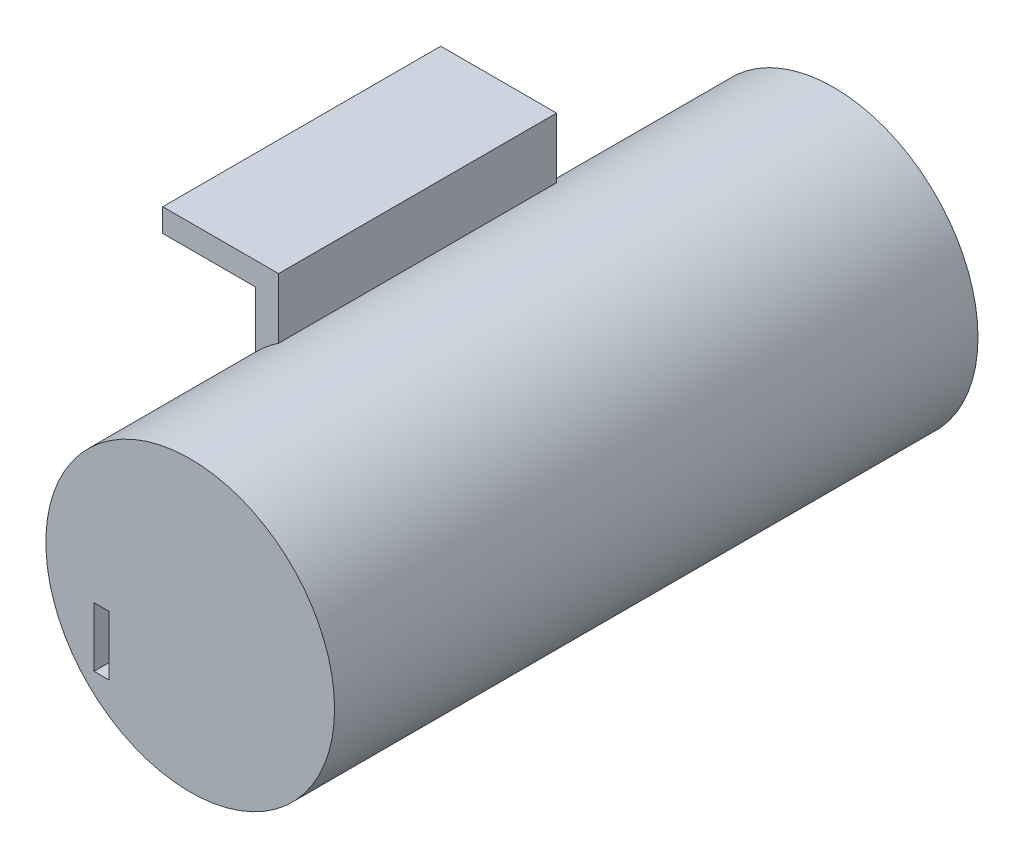
ISO-10303-21;
HEADER;
FILE_DESCRIPTION(('STEP AP214'),'2;1');
FILE_NAME('part.step','',(''),(''),'','','');
FILE_SCHEMA(('AUTOMOTIVE_DESIGN { 1 0 10303 214 1 1 1 1 }'));
ENDSEC;
DATA;
#1=APPLICATION_CONTEXT('core data for automotive mechanical design processes');
#2=APPLICATION_PROTOCOL_DEFINITION('international standard','automotive_design',2000,#1);
#3=PRODUCT_CONTEXT('',#1,'mechanical');
#4=PRODUCT('Part','Part','',(#3));
#5=PRODUCT_RELATED_PRODUCT_CATEGORY('part','',(#4));
#6=PRODUCT_DEFINITION_FORMATION('','',#4);
#7=PRODUCT_DEFINITION_CONTEXT('part definition',#1,'design');
#8=PRODUCT_DEFINITION('design','',#6,#7);
#9=PRODUCT_DEFINITION_SHAPE('','',#8);
#10=(LENGTH_UNIT() NAMED_UNIT(*) SI_UNIT(.MILLI.,.METRE.));
#11=(NAMED_UNIT(*) PLANE_ANGLE_UNIT() SI_UNIT($,.RADIAN.));
#12=(NAMED_UNIT(*) SI_UNIT($,.STERADIAN.) SOLID_ANGLE_UNIT());
#13=UNCERTAINTY_MEASURE_WITH_UNIT(LENGTH_MEASURE(1.E-05),#10,'distance_accuracy_value','');
#14=(GEOMETRIC_REPRESENTATION_CONTEXT(3) GLOBAL_UNCERTAINTY_ASSIGNED_CONTEXT((#13)) GLOBAL_UNIT_ASSIGNED_CONTEXT((#10,
#11,#12)) REPRESENTATION_CONTEXT('',''));
#15=CARTESIAN_POINT('',(0.,0.,0.));
#16=DIRECTION('',(0.,0.,1.));
#17=DIRECTION('',(1.,0.,0.));
#18=AXIS2_PLACEMENT_3D('',#15,#16,#17);
#19=CARTESIAN_POINT('',(-9.81200661546478,0.,38.1));
#20=DIRECTION('',(1.,0.,0.));
#21=DIRECTION('',(0.,1.,0.));
#22=AXIS2_PLACEMENT_3D('',#19,#20,#21);
#23=PLANE('',#22);
#24=DIRECTION('',(0.,0.,1.));
#25=VECTOR('',#24,1.);
#26=CARTESIAN_POINT('',(-9.81200661546478,0.974223450392017,-27.));
#27=LINE('',#26,#25);
#28=CARTESIAN_POINT('',(-9.81200661546478,0.974223450392015,38.1));
#29=VERTEX_POINT('',#28);
#30=CARTESIAN_POINT('',(-9.81200661546478,0.974223450392015,0.));
#31=VERTEX_POINT('',#30);
#32=EDGE_CURVE('E189',#29,#31,#27,.F.);
#33=ORIENTED_EDGE('',*,*,#32,.F.);
#34=DIRECTION('',(0.,-1.,0.));
#35=VECTOR('',#34,1.);
#36=CARTESIAN_POINT('',(-9.81200661546478,0.,38.1));
#37=LINE('',#36,#35);
#38=CARTESIAN_POINT('',(-9.81200661546479,8.7007021203464,38.1));
#39=VERTEX_POINT('',#38);
#40=EDGE_CURVE('E202',#39,#29,#37,.T.);
#41=ORIENTED_EDGE('',*,*,#40,.F.);
#42=DIRECTION('',(0.,0.,-1.));
#43=VECTOR('',#42,1.);
#44=CARTESIAN_POINT('',(-9.81200661546479,8.7007021203464,38.1));
#45=LINE('',#44,#43);
#46=CARTESIAN_POINT('',(-9.81200661546479,8.7007021203464,0.));
#47=VERTEX_POINT('',#46);
#48=EDGE_CURVE('E236',#39,#47,#45,.T.);
#49=ORIENTED_EDGE('',*,*,#48,.T.);
#50=DIRECTION('',(0.,-1.,0.));
#51=VECTOR('',#50,1.);
#52=CARTESIAN_POINT('',(-9.81200661546478,0.,0.));
#53=LINE('',#52,#51);
#54=EDGE_CURVE('E220',#47,#31,#53,.T.);
#55=ORIENTED_EDGE('',*,*,#54,.T.);
#56=EDGE_LOOP('',(#33,#41,#49,#55));
#57=FACE_BOUND('',#56,.T.);
#58=ADVANCED_FACE('F36',(#57),#23,.F.);
#59=CARTESIAN_POINT('',(-6.63700661546478,0.,38.1));
#60=DIRECTION('',(1.,0.,0.));
#61=DIRECTION('',(0.,1.,0.));
#62=AXIS2_PLACEMENT_3D('',#59,#60,#61);
#63=PLANE('',#62);
#64=DIRECTION('',(0.,-1.,0.));
#65=VECTOR('',#64,1.);
#66=CARTESIAN_POINT('',(-6.63700661546478,0.,38.1));
#67=LINE('',#66,#65);
#68=CARTESIAN_POINT('',(-6.63700661546479,11.8757021203464,38.1));
#69=VERTEX_POINT('',#68);
#70=CARTESIAN_POINT('',(-6.63700661546478,3.60496778517396,38.1));
#71=VERTEX_POINT('',#70);
#72=EDGE_CURVE('E209',#69,#71,#67,.T.);
#73=ORIENTED_EDGE('',*,*,#72,.T.);
#74=DIRECTION('',(0.,0.,1.));
#75=VECTOR('',#74,1.);
#76=CARTESIAN_POINT('',(-6.63700661546478,3.60496778517396,-27.));
#77=LINE('',#76,#75);
#78=CARTESIAN_POINT('',(-6.63700661546478,3.60496778517396,0.));
#79=VERTEX_POINT('',#78);
#80=EDGE_CURVE('E186',#71,#79,#77,.F.);
#81=ORIENTED_EDGE('',*,*,#80,.T.);
#82=DIRECTION('',(0.,-1.,0.));
#83=VECTOR('',#82,1.);
#84=CARTESIAN_POINT('',(-6.63700661546478,0.,0.));
#85=LINE('',#84,#83);
#86=CARTESIAN_POINT('',(-6.63700661546479,11.8757021203464,0.));
#87=VERTEX_POINT('',#86);
#88=EDGE_CURVE('E226',#87,#79,#85,.T.);
#89=ORIENTED_EDGE('',*,*,#88,.F.);
#90=DIRECTION('',(0.,0.,-1.));
#91=VECTOR('',#90,1.);
#92=CARTESIAN_POINT('',(-6.63700661546479,11.8757021203464,38.1));
#93=LINE('',#92,#91);
#94=EDGE_CURVE('E231',#69,#87,#93,.T.);
#95=ORIENTED_EDGE('',*,*,#94,.F.);
#96=EDGE_LOOP('',(#73,#81,#89,#95));
#97=FACE_BOUND('',#96,.T.);
#98=ADVANCED_FACE('F267',(#97),#63,.T.);
#99=CARTESIAN_POINT('',(-22.5120066154648,0.,38.1));
#100=DIRECTION('',(-1.,0.,0.));
#101=DIRECTION('',(0.,0.,1.));
#102=AXIS2_PLACEMENT_3D('',#99,#100,#101);
#103=PLANE('',#102);
#104=DIRECTION('',(0.,1.,0.));
#105=VECTOR('',#104,1.);
#106=CARTESIAN_POINT('',(-22.5120066154648,0.,0.));
#107=LINE('',#106,#105);
#108=CARTESIAN_POINT('',(-22.5120066154648,8.7007021203464,0.));
#109=VERTEX_POINT('',#108);
#110=CARTESIAN_POINT('',(-22.5120066154648,11.8757021203464,0.));
#111=VERTEX_POINT('',#110);
#112=EDGE_CURVE('E194',#109,#111,#107,.T.);
#113=ORIENTED_EDGE('',*,*,#112,.F.);
#114=DIRECTION('',(0.,0.,-1.));
#115=VECTOR('',#114,1.);
#116=CARTESIAN_POINT('',(-22.5120066154648,8.7007021203464,38.1));
#117=LINE('',#116,#115);
#118=CARTESIAN_POINT('',(-22.5120066154648,8.7007021203464,38.1));
#119=VERTEX_POINT('',#118);
#120=EDGE_CURVE('E238',#119,#109,#117,.T.);
#121=ORIENTED_EDGE('',*,*,#120,.F.);
#122=DIRECTION('',(0.,1.,0.));
#123=VECTOR('',#122,1.);
#124=CARTESIAN_POINT('',(-22.5120066154648,0.,38.1));
#125=LINE('',#124,#123);
#126=CARTESIAN_POINT('',(-22.5120066154648,11.8757021203464,38.1));
#127=VERTEX_POINT('',#126);
#128=EDGE_CURVE('E195',#119,#127,#125,.T.);
#129=ORIENTED_EDGE('',*,*,#128,.T.);
#130=DIRECTION('',(0.,0.,-1.));
#131=VECTOR('',#130,1.);
#132=CARTESIAN_POINT('',(-22.5120066154648,11.8757021203464,38.1));
#133=LINE('',#132,#131);
#134=EDGE_CURVE('E214',#127,#111,#133,.T.);
#135=ORIENTED_EDGE('',*,*,#134,.T.);
#136=EDGE_LOOP('',(#113,#121,#129,#135));
#137=FACE_BOUND('',#136,.T.);
#138=ADVANCED_FACE('F38',(#137),#103,.T.);
#139=CARTESIAN_POINT('',(0.,8.7007021203464,38.1));
#140=DIRECTION('',(0.,-1.,0.));
#141=DIRECTION('',(0.,0.,-1.));
#142=AXIS2_PLACEMENT_3D('',#139,#140,#141);
#143=PLANE('',#142);
#144=DIRECTION('',(-1.,0.,0.));
#145=VECTOR('',#144,1.);
#146=CARTESIAN_POINT('',(0.,8.7007021203464,0.));
#147=LINE('',#146,#145);
#148=EDGE_CURVE('E217',#47,#109,#147,.T.);
#149=ORIENTED_EDGE('',*,*,#148,.F.);
#150=ORIENTED_EDGE('',*,*,#48,.F.);
#151=DIRECTION('',(-1.,0.,0.));
#152=VECTOR('',#151,1.);
#153=CARTESIAN_POINT('',(0.,8.7007021203464,38.1));
#154=LINE('',#153,#152);
#155=EDGE_CURVE('E198',#39,#119,#154,.T.);
#156=ORIENTED_EDGE('',*,*,#155,.T.);
#157=ORIENTED_EDGE('',*,*,#120,.T.);
#158=EDGE_LOOP('',(#149,#150,#156,#157));
#159=FACE_BOUND('',#158,.T.);
#160=ADVANCED_FACE('F282',(#159),#143,.T.);
#161=CARTESIAN_POINT('',(0.,11.8757021203464,38.1));
#162=DIRECTION('',(0.,-1.,0.));
#163=DIRECTION('',(1.,0.,0.));
#164=AXIS2_PLACEMENT_3D('',#161,#162,#163);
#165=PLANE('',#164);
#166=DIRECTION('',(-1.,0.,0.));
#167=VECTOR('',#166,1.);
#168=CARTESIAN_POINT('',(0.,11.8757021203464,0.));
#169=LINE('',#168,#167);
#170=EDGE_CURVE('E199',#87,#111,#169,.T.);
#171=ORIENTED_EDGE('',*,*,#170,.T.);
#172=ORIENTED_EDGE('',*,*,#134,.F.);
#173=DIRECTION('',(-1.,0.,0.));
#174=VECTOR('',#173,1.);
#175=CARTESIAN_POINT('',(0.,11.8757021203464,38.1));
#176=LINE('',#175,#174);
#177=EDGE_CURVE('E212',#69,#127,#176,.T.);
#178=ORIENTED_EDGE('',*,*,#177,.F.);
#179=ORIENTED_EDGE('',*,*,#94,.T.);
#180=EDGE_LOOP('',(#171,#172,#178,#179));
#181=FACE_BOUND('',#180,.T.);
#182=ADVANCED_FACE('F272',(#181),#165,.F.);
#183=CARTESIAN_POINT('',(0.,0.,38.1));
#184=DIRECTION('',(0.,0.,1.));
#185=DIRECTION('',(1.,0.,0.));
#186=AXIS2_PLACEMENT_3D('',#183,#184,#185);
#187=PLANE('',#186);
#188=ORIENTED_EDGE('',*,*,#40,.T.);
#189=CARTESIAN_POINT('',(4.32977813053361,-12.8619542844802,38.1));
#190=DIRECTION('',(0.,0.,1.));
#191=DIRECTION('',(1.,0.,0.));
#192=AXIS2_PLACEMENT_3D('',#189,#190,#191);
#193=CIRCLE('',#192,19.7845871858153);
#194=EDGE_CURVE('E192',#29,#71,#193,.F.);
#195=ORIENTED_EDGE('',*,*,#194,.T.);
#196=ORIENTED_EDGE('',*,*,#72,.F.);
#197=ORIENTED_EDGE('',*,*,#177,.T.);
#198=ORIENTED_EDGE('',*,*,#128,.F.);
#199=ORIENTED_EDGE('',*,*,#155,.F.);
#200=EDGE_LOOP('',(#188,#195,#196,#197,#198,#199));
#201=FACE_BOUND('',#200,.T.);
#202=ADVANCED_FACE('F261',(#201),#187,.T.);
#203=CARTESIAN_POINT('',(0.,0.,0.));
#204=DIRECTION('',(0.,0.,1.));
#205=DIRECTION('',(1.,0.,0.));
#206=AXIS2_PLACEMENT_3D('',#203,#204,#205);
#207=PLANE('',#206);
#208=CARTESIAN_POINT('',(4.32977813053361,-12.8619542844802,0.));
#209=DIRECTION('',(0.,0.,1.));
#210=DIRECTION('',(1.,0.,0.));
#211=AXIS2_PLACEMENT_3D('',#208,#209,#210);
#212=CIRCLE('',#211,19.7845871858153);
#213=EDGE_CURVE('E11',#31,#79,#212,.F.);
#214=ORIENTED_EDGE('',*,*,#213,.F.);
#215=ORIENTED_EDGE('',*,*,#54,.F.);
#216=ORIENTED_EDGE('',*,*,#148,.T.);
#217=ORIENTED_EDGE('',*,*,#112,.T.);
#218=ORIENTED_EDGE('',*,*,#170,.F.);
#219=ORIENTED_EDGE('',*,*,#88,.T.);
#220=EDGE_LOOP('',(#214,#215,#216,#217,#218,#219));
#221=FACE_BOUND('',#220,.T.);
#222=ADVANCED_FACE('F269',(#221),#207,.F.);
#223=CARTESIAN_POINT('',(4.32977813053361,-12.8619542844802,-27.));
#224=DIRECTION('',(0.,0.,-1.));
#225=DIRECTION('',(-1.,0.,0.));
#226=AXIS2_PLACEMENT_3D('',#223,#224,#225);
#227=PLANE('',#226);
#228=CARTESIAN_POINT('',(4.32977813053361,-12.8619542844802,-27.));
#229=DIRECTION('',(0.,0.,-1.));
#230=DIRECTION('',(-1.,0.,0.));
#231=AXIS2_PLACEMENT_3D('',#228,#229,#230);
#232=CIRCLE('',#231,19.7845871858153);
#233=CARTESIAN_POINT('',(-15.4548090552817,-12.8619542844802,-27.));
#234=VERTEX_POINT('',#233);
#235=EDGE_CURVE('E176',#234,#234,#232,.T.);
#236=ORIENTED_EDGE('',*,*,#235,.T.);
#237=EDGE_LOOP('',(#236));
#238=FACE_BOUND('',#237,.T.);
#239=CARTESIAN_POINT('',(4.32977813053361,-12.8619542844802,-27.));
#240=DIRECTION('',(0.,0.,-1.));
#241=DIRECTION('',(-1.,0.,0.));
#242=AXIS2_PLACEMENT_3D('',#239,#240,#241);
#243=CIRCLE('',#242,18.3999999999997);
#244=CARTESIAN_POINT('',(-14.0702218694661,-12.8619542844802,-27.));
#245=VERTEX_POINT('',#244);
#246=EDGE_CURVE('E173',#245,#245,#243,.T.);
#247=ORIENTED_EDGE('',*,*,#246,.F.);
#248=EDGE_LOOP('',(#247));
#249=FACE_BOUND('',#248,.T.);
#250=ADVANCED_FACE('F310',(#238,#249),#227,.T.);
#251=CARTESIAN_POINT('',(4.32977813053361,-12.8619542844802,-27.));
#252=DIRECTION('',(0.,0.,1.));
#253=DIRECTION('',(1.,0.,0.));
#254=AXIS2_PLACEMENT_3D('',#251,#252,#253);
#255=CYLINDRICAL_SURFACE('',#254,19.7845871858153);
#256=ORIENTED_EDGE('',*,*,#194,.F.);
#257=ORIENTED_EDGE('',*,*,#32,.T.);
#258=ORIENTED_EDGE('',*,*,#213,.T.);
#259=ORIENTED_EDGE('',*,*,#80,.F.);
#260=EDGE_LOOP('',(#256,#257,#258,#259));
#261=FACE_BOUND('',#260,.T.);
#262=ORIENTED_EDGE('',*,*,#235,.F.);
#263=EDGE_LOOP('',(#262));
#264=FACE_BOUND('',#263,.T.);
#265=CARTESIAN_POINT('',(4.32977813053361,-12.8619542844802,61.175));
#266=DIRECTION('',(0.,0.,1.));
#267=DIRECTION('',(1.,0.,0.));
#268=AXIS2_PLACEMENT_3D('',#265,#266,#267);
#269=CIRCLE('',#268,19.7845871858153);
#270=CARTESIAN_POINT('',(24.1143653163489,-12.8619542844802,61.175));
#271=VERTEX_POINT('',#270);
#272=EDGE_CURVE('E164',#271,#271,#269,.T.);
#273=ORIENTED_EDGE('',*,*,#272,.F.);
#274=EDGE_LOOP('',(#273));
#275=FACE_BOUND('',#274,.T.);
#276=ADVANCED_FACE('F300',(#261,#264,#275),#255,.T.);
#277=CARTESIAN_POINT('',(4.32977813053361,-12.8619542844802,-27.));
#278=DIRECTION('',(0.,0.,1.));
#279=DIRECTION('',(1.,0.,0.));
#280=AXIS2_PLACEMENT_3D('',#277,#278,#279);
#281=CYLINDRICAL_SURFACE('',#280,18.3999999999997);
#282=DIRECTION('',(0.,0.,1.));
#283=VECTOR('',#282,1.);
#284=CARTESIAN_POINT('',(-7.91100601521927,0.875702120346397,-27.));
#285=LINE('',#284,#283);
#286=CARTESIAN_POINT('',(-7.91100601521927,0.875702120346397,38.1));
#287=VERTEX_POINT('',#286);
#288=CARTESIAN_POINT('',(-7.91100601521927,0.8757021203464,0.));
#289=VERTEX_POINT('',#288);
#290=EDGE_CURVE('E181',#287,#289,#285,.F.);
#291=ORIENTED_EDGE('',*,*,#290,.F.);
#292=CARTESIAN_POINT('',(4.32977813053361,-12.8619542844802,38.1));
#293=DIRECTION('',(0.,0.,1.));
#294=DIRECTION('',(1.,0.,0.));
#295=AXIS2_PLACEMENT_3D('',#292,#293,#294);
#296=CIRCLE('',#295,18.3999999999997);
#297=CARTESIAN_POINT('',(-6.63700661546478,1.91267370863439,38.1));
#298=VERTEX_POINT('',#297);
#299=EDGE_CURVE('E184',#287,#298,#296,.F.);
#300=ORIENTED_EDGE('',*,*,#299,.T.);
#301=DIRECTION('',(0.,0.,1.));
#302=VECTOR('',#301,1.);
#303=CARTESIAN_POINT('',(-6.63700661546478,1.91267370863439,-27.));
#304=LINE('',#303,#302);
#305=CARTESIAN_POINT('',(-6.63700661546478,1.91267370863439,0.));
#306=VERTEX_POINT('',#305);
#307=EDGE_CURVE('E179',#298,#306,#304,.F.);
#308=ORIENTED_EDGE('',*,*,#307,.T.);
#309=CARTESIAN_POINT('',(4.32977813053361,-12.8619542844802,0.));
#310=DIRECTION('',(0.,0.,1.));
#311=DIRECTION('',(1.,0.,0.));
#312=AXIS2_PLACEMENT_3D('',#309,#310,#311);
#313=CIRCLE('',#312,18.3999999999997);
#314=EDGE_CURVE('E44',#289,#306,#313,.F.);
#315=ORIENTED_EDGE('',*,*,#314,.F.);
#316=EDGE_LOOP('',(#291,#300,#308,#315));
#317=FACE_BOUND('',#316,.T.);
#318=ORIENTED_EDGE('',*,*,#246,.T.);
#319=EDGE_LOOP('',(#318));
#320=FACE_BOUND('',#319,.T.);
#321=CARTESIAN_POINT('',(4.32977813053361,-12.8619542844802,58.));
#322=DIRECTION('',(0.,0.,-1.));
#323=DIRECTION('',(-1.,0.,0.));
#324=AXIS2_PLACEMENT_3D('',#321,#322,#323);
#325=CIRCLE('',#324,18.3999999999997);
#326=CARTESIAN_POINT('',(-14.0702218694661,-12.8619542844802,58.));
#327=VERTEX_POINT('',#326);
#328=EDGE_CURVE('E170',#327,#327,#325,.T.);
#329=ORIENTED_EDGE('',*,*,#328,.F.);
#330=EDGE_LOOP('',(#329));
#331=FACE_BOUND('',#330,.T.);
#332=ADVANCED_FACE('F255',(#317,#320,#331),#281,.F.);
#333=DIRECTION('',(1.,0.,0.));
#334=VECTOR('',#333,1.);
#335=CARTESIAN_POINT('',(0.,0.8757021203464,0.));
#336=LINE('',#335,#334);
#337=CARTESIAN_POINT('',(-6.63700661546478,0.8757021203464,0.));
#338=VERTEX_POINT('',#337);
#339=EDGE_CURVE('E223',#289,#338,#336,.T.);
#340=ORIENTED_EDGE('',*,*,#339,.F.);
#341=ORIENTED_EDGE('',*,*,#314,.T.);
#342=EDGE_CURVE('E225',#306,#338,#85,.T.);
#343=ORIENTED_EDGE('',*,*,#342,.T.);
#344=EDGE_LOOP('',(#340,#341,#343));
#345=FACE_BOUND('',#344,.T.);
#346=ADVANCED_FACE('F244',(#345),#207,.F.);
#347=ORIENTED_EDGE('',*,*,#299,.F.);
#348=DIRECTION('',(1.,0.,0.));
#349=VECTOR('',#348,1.);
#350=CARTESIAN_POINT('',(0.,0.8757021203464,38.1));
#351=LINE('',#350,#349);
#352=CARTESIAN_POINT('',(-6.63700661546478,0.8757021203464,38.1));
#353=VERTEX_POINT('',#352);
#354=EDGE_CURVE('E205',#287,#353,#351,.T.);
#355=ORIENTED_EDGE('',*,*,#354,.T.);
#356=EDGE_CURVE('E208',#298,#353,#67,.T.);
#357=ORIENTED_EDGE('',*,*,#356,.F.);
#358=EDGE_LOOP('',(#347,#355,#357));
#359=FACE_BOUND('',#358,.T.);
#360=ADVANCED_FACE('F258',(#359),#187,.T.);
#361=ORIENTED_EDGE('',*,*,#307,.F.);
#362=ORIENTED_EDGE('',*,*,#356,.T.);
#363=DIRECTION('',(0.,0.,-1.));
#364=VECTOR('',#363,1.);
#365=CARTESIAN_POINT('',(-6.63700661546478,0.8757021203464,38.1));
#366=LINE('',#365,#364);
#367=EDGE_CURVE('E233',#353,#338,#366,.T.);
#368=ORIENTED_EDGE('',*,*,#367,.T.);
#369=ORIENTED_EDGE('',*,*,#342,.F.);
#370=EDGE_LOOP('',(#361,#362,#368,#369));
#371=FACE_BOUND('',#370,.T.);
#372=ADVANCED_FACE('F248',(#371),#63,.T.);
#373=CARTESIAN_POINT('',(0.,0.8757021203464,38.1));
#374=DIRECTION('',(0.,1.,0.));
#375=DIRECTION('',(0.,0.,1.));
#376=AXIS2_PLACEMENT_3D('',#373,#374,#375);
#377=PLANE('',#376);
#378=ORIENTED_EDGE('',*,*,#354,.F.);
#379=ORIENTED_EDGE('',*,*,#290,.T.);
#380=ORIENTED_EDGE('',*,*,#339,.T.);
#381=ORIENTED_EDGE('',*,*,#367,.F.);
#382=EDGE_LOOP('',(#378,#379,#380,#381));
#383=FACE_BOUND('',#382,.T.);
#384=ADVANCED_FACE('F253',(#383),#377,.F.);
#385=CARTESIAN_POINT('',(4.32977813053361,-12.8619542844802,58.));
#386=DIRECTION('',(0.,0.,1.));
#387=DIRECTION('',(1.,0.,0.));
#388=AXIS2_PLACEMENT_3D('',#385,#386,#387);
#389=PLANE('',#388);
#390=DIRECTION('',(-1.,0.,0.));
#391=VECTOR('',#390,1.);
#392=CARTESIAN_POINT('',(-8.84959069564224,-16.750821194732,58.));
#393=LINE('',#392,#391);
#394=CARTESIAN_POINT('',(-6.79623536668814,-16.750821194732,58.));
#395=VERTEX_POINT('',#394);
#396=CARTESIAN_POINT('',(-8.84959069564224,-16.750821194732,58.));
#397=VERTEX_POINT('',#396);
#398=EDGE_CURVE('E139',#395,#397,#393,.T.);
#399=ORIENTED_EDGE('',*,*,#398,.T.);
#400=DIRECTION('',(0.,-1.,0.));
#401=VECTOR('',#400,1.);
#402=CARTESIAN_POINT('',(-8.84959069564224,-16.750821194732,58.));
#403=LINE('',#402,#401);
#404=CARTESIAN_POINT('',(-8.84959069564224,-24.8957973329166,58.));
#405=VERTEX_POINT('',#404);
#406=EDGE_CURVE('E133',#397,#405,#403,.T.);
#407=ORIENTED_EDGE('',*,*,#406,.T.);
#408=DIRECTION('',(1.,0.,0.));
#409=VECTOR('',#408,1.);
#410=CARTESIAN_POINT('',(-8.84959069564224,-24.8957973329166,58.));
#411=LINE('',#410,#409);
#412=CARTESIAN_POINT('',(-6.79623536668814,-24.8957973329166,58.));
#413=VERTEX_POINT('',#412);
#414=EDGE_CURVE('E142',#405,#413,#411,.T.);
#415=ORIENTED_EDGE('',*,*,#414,.T.);
#416=DIRECTION('',(0.,1.,0.));
#417=VECTOR('',#416,1.);
#418=CARTESIAN_POINT('',(-6.79623536668814,-16.750821194732,58.));
#419=LINE('',#418,#417);
#420=EDGE_CURVE('E51',#413,#395,#419,.T.);
#421=ORIENTED_EDGE('',*,*,#420,.T.);
#422=EDGE_LOOP('',(#399,#407,#415,#421));
#423=FACE_BOUND('',#422,.T.);
#424=ORIENTED_EDGE('',*,*,#328,.T.);
#425=EDGE_LOOP('',(#424));
#426=FACE_BOUND('',#425,.T.);
#427=ADVANCED_FACE('F146',(#423,#426),#389,.F.);
#428=CARTESIAN_POINT('',(4.32977813053361,-12.8619542844802,61.175));
#429=DIRECTION('',(0.,0.,1.));
#430=DIRECTION('',(1.,0.,0.));
#431=AXIS2_PLACEMENT_3D('',#428,#429,#430);
#432=PLANE('',#431);
#433=DIRECTION('',(0.,-1.,0.));
#434=VECTOR('',#433,1.);
#435=CARTESIAN_POINT('',(-8.84959069564224,-16.750821194732,61.175));
#436=LINE('',#435,#434);
#437=CARTESIAN_POINT('',(-8.84959069564224,-16.750821194732,61.175));
#438=VERTEX_POINT('',#437);
#439=CARTESIAN_POINT('',(-8.84959069564224,-24.8957973329166,61.175));
#440=VERTEX_POINT('',#439);
#441=EDGE_CURVE('E59',#438,#440,#436,.T.);
#442=ORIENTED_EDGE('',*,*,#441,.F.);
#443=DIRECTION('',(-1.,0.,0.));
#444=VECTOR('',#443,1.);
#445=CARTESIAN_POINT('',(-8.84959069564224,-16.750821194732,61.175));
#446=LINE('',#445,#444);
#447=CARTESIAN_POINT('',(-6.79623536668814,-16.750821194732,61.175));
#448=VERTEX_POINT('',#447);
#449=EDGE_CURVE('E149',#448,#438,#446,.T.);
#450=ORIENTED_EDGE('',*,*,#449,.F.);
#451=DIRECTION('',(0.,1.,0.));
#452=VECTOR('',#451,1.);
#453=CARTESIAN_POINT('',(-6.79623536668814,-16.750821194732,61.175));
#454=LINE('',#453,#452);
#455=CARTESIAN_POINT('',(-6.79623536668814,-24.8957973329166,61.175));
#456=VERTEX_POINT('',#455);
#457=EDGE_CURVE('E152',#456,#448,#454,.T.);
#458=ORIENTED_EDGE('',*,*,#457,.F.);
#459=DIRECTION('',(1.,0.,0.));
#460=VECTOR('',#459,1.);
#461=CARTESIAN_POINT('',(-8.84959069564224,-24.8957973329166,61.175));
#462=LINE('',#461,#460);
#463=EDGE_CURVE('E158',#440,#456,#462,.T.);
#464=ORIENTED_EDGE('',*,*,#463,.F.);
#465=EDGE_LOOP('',(#442,#450,#458,#464));
#466=FACE_BOUND('',#465,.T.);
#467=ORIENTED_EDGE('',*,*,#272,.T.);
#468=EDGE_LOOP('',(#467));
#469=FACE_BOUND('',#468,.T.);
#470=ADVANCED_FACE('F315',(#466,#469),#432,.T.);
#471=CARTESIAN_POINT('',(-8.84959069564224,-16.750821194732,58.));
#472=DIRECTION('',(-1.,0.,0.));
#473=DIRECTION('',(0.,0.,1.));
#474=AXIS2_PLACEMENT_3D('',#471,#472,#473);
#475=PLANE('',#474);
#476=ORIENTED_EDGE('',*,*,#441,.T.);
#477=DIRECTION('',(0.,0.,1.));
#478=VECTOR('',#477,1.);
#479=CARTESIAN_POINT('',(-8.84959069564224,-24.8957973329166,58.));
#480=LINE('',#479,#478);
#481=EDGE_CURVE('E129',#405,#440,#480,.T.);
#482=ORIENTED_EDGE('',*,*,#481,.F.);
#483=ORIENTED_EDGE('',*,*,#406,.F.);
#484=DIRECTION('',(0.,0.,1.));
#485=VECTOR('',#484,1.);
#486=CARTESIAN_POINT('',(-8.84959069564224,-16.750821194732,58.));
#487=LINE('',#486,#485);
#488=EDGE_CURVE('E162',#397,#438,#487,.T.);
#489=ORIENTED_EDGE('',*,*,#488,.T.);
#490=EDGE_LOOP('',(#476,#482,#483,#489));
#491=FACE_BOUND('',#490,.T.);
#492=ADVANCED_FACE('F131',(#491),#475,.F.);
#493=CARTESIAN_POINT('',(-8.84959069564224,-16.750821194732,58.));
#494=DIRECTION('',(0.,1.,0.));
#495=DIRECTION('',(0.,0.,1.));
#496=AXIS2_PLACEMENT_3D('',#493,#494,#495);
#497=PLANE('',#496);
#498=ORIENTED_EDGE('',*,*,#449,.T.);
#499=ORIENTED_EDGE('',*,*,#488,.F.);
#500=ORIENTED_EDGE('',*,*,#398,.F.);
#501=DIRECTION('',(0.,0.,1.));
#502=VECTOR('',#501,1.);
#503=CARTESIAN_POINT('',(-6.79623536668814,-16.750821194732,58.));
#504=LINE('',#503,#502);
#505=EDGE_CURVE('E165',#395,#448,#504,.T.);
#506=ORIENTED_EDGE('',*,*,#505,.T.);
#507=EDGE_LOOP('',(#498,#499,#500,#506));
#508=FACE_BOUND('',#507,.T.);
#509=ADVANCED_FACE('F323',(#508),#497,.F.);
#510=CARTESIAN_POINT('',(-6.79623536668814,-16.750821194732,58.));
#511=DIRECTION('',(1.,0.,0.));
#512=DIRECTION('',(0.,0.,-1.));
#513=AXIS2_PLACEMENT_3D('',#510,#511,#512);
#514=PLANE('',#513);
#515=ORIENTED_EDGE('',*,*,#457,.T.);
#516=ORIENTED_EDGE('',*,*,#505,.F.);
#517=ORIENTED_EDGE('',*,*,#420,.F.);
#518=DIRECTION('',(0.,0.,1.));
#519=VECTOR('',#518,1.);
#520=CARTESIAN_POINT('',(-6.79623536668814,-24.8957973329166,58.));
#521=LINE('',#520,#519);
#522=EDGE_CURVE('E138',#413,#456,#521,.T.);
#523=ORIENTED_EDGE('',*,*,#522,.T.);
#524=EDGE_LOOP('',(#515,#516,#517,#523));
#525=FACE_BOUND('',#524,.T.);
#526=ADVANCED_FACE('F440',(#525),#514,.F.);
#527=CARTESIAN_POINT('',(-8.84959069564224,-24.8957973329166,58.));
#528=DIRECTION('',(0.,-1.,0.));
#529=DIRECTION('',(0.,0.,-1.));
#530=AXIS2_PLACEMENT_3D('',#527,#528,#529);
#531=PLANE('',#530);
#532=ORIENTED_EDGE('',*,*,#463,.T.);
#533=ORIENTED_EDGE('',*,*,#522,.F.);
#534=ORIENTED_EDGE('',*,*,#414,.F.);
#535=ORIENTED_EDGE('',*,*,#481,.T.);
#536=EDGE_LOOP('',(#532,#533,#534,#535));
#537=FACE_BOUND('',#536,.T.);
#538=ADVANCED_FACE('F143',(#537),#531,.F.);
#539=CLOSED_SHELL('',(#58,#98,#138,#160,#182,#202,#222,#250,#276,#332,#346,#360,#372,#384,#427,
#470,#492,#509,#526,#538));
#540=MANIFOLD_SOLID_BREP('B2',#539);
#541=ADVANCED_BREP_SHAPE_REPRESENTATION('',(#18,#540),#14);
#542=SHAPE_DEFINITION_REPRESENTATION(#9,#541);
ENDSEC;
END-ISO-10303-21;
